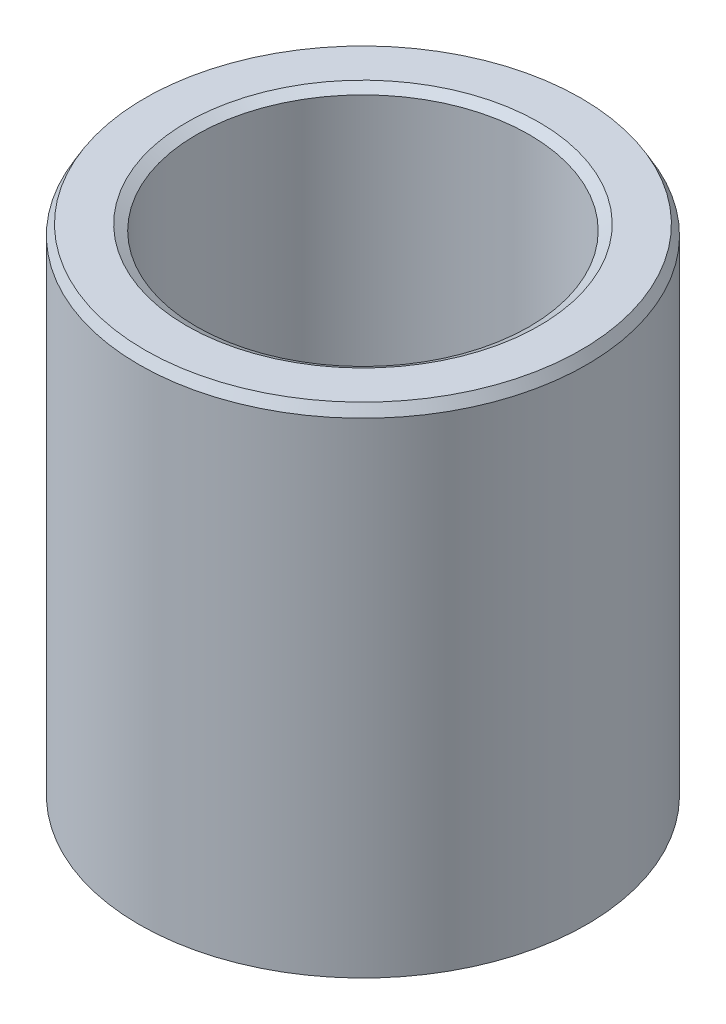
ISO-10303-21;
HEADER;
FILE_DESCRIPTION(('STEP AP214'),'2;1');
FILE_NAME('part.step','',(''),(''),'','','');
FILE_SCHEMA(('AUTOMOTIVE_DESIGN { 1 0 10303 214 1 1 1 1 }'));
ENDSEC;
DATA;
#1=APPLICATION_CONTEXT('core data for automotive mechanical design processes');
#2=APPLICATION_PROTOCOL_DEFINITION('international standard','automotive_design',2000,#1);
#3=PRODUCT_CONTEXT('',#1,'mechanical');
#4=PRODUCT('Part','Part','',(#3));
#5=PRODUCT_RELATED_PRODUCT_CATEGORY('part','',(#4));
#6=PRODUCT_DEFINITION_FORMATION('','',#4);
#7=PRODUCT_DEFINITION_CONTEXT('part definition',#1,'design');
#8=PRODUCT_DEFINITION('design','',#6,#7);
#9=PRODUCT_DEFINITION_SHAPE('','',#8);
#10=(LENGTH_UNIT() NAMED_UNIT(*) SI_UNIT(.MILLI.,.METRE.));
#11=(NAMED_UNIT(*) PLANE_ANGLE_UNIT() SI_UNIT($,.RADIAN.));
#12=(NAMED_UNIT(*) SI_UNIT($,.STERADIAN.) SOLID_ANGLE_UNIT());
#13=UNCERTAINTY_MEASURE_WITH_UNIT(LENGTH_MEASURE(1.E-05),#10,'distance_accuracy_value','');
#14=(GEOMETRIC_REPRESENTATION_CONTEXT(3) GLOBAL_UNCERTAINTY_ASSIGNED_CONTEXT((#13)) GLOBAL_UNIT_ASSIGNED_CONTEXT((#10,
#11,#12)) REPRESENTATION_CONTEXT('',''));
#15=CARTESIAN_POINT('',(0.,0.,0.));
#16=DIRECTION('',(0.,0.,1.));
#17=DIRECTION('',(1.,0.,0.));
#18=AXIS2_PLACEMENT_3D('',#15,#16,#17);
#19=CARTESIAN_POINT('',(0.,50.2971991655654,0.));
#20=DIRECTION('',(0.,-1.,0.));
#21=DIRECTION('',(0.,0.,-1.));
#22=AXIS2_PLACEMENT_3D('',#19,#20,#21);
#23=CYLINDRICAL_SURFACE('',#22,22.5);
#24=CARTESIAN_POINT('',(0.,0.574537010156938,0.));
#25=DIRECTION('',(0.,1.,0.));
#26=DIRECTION('',(0.,0.,1.));
#27=AXIS2_PLACEMENT_3D('',#24,#25,#26);
#28=CIRCLE('',#27,22.5);
#29=CARTESIAN_POINT('',(0.,0.574537010156938,22.5));
#30=VERTEX_POINT('',#29);
#31=EDGE_CURVE('E10',#30,#30,#28,.T.);
#32=ORIENTED_EDGE('',*,*,#31,.T.);
#33=EDGE_LOOP('',(#32));
#34=FACE_BOUND('',#33,.T.);
#35=CARTESIAN_POINT('',(0.,49.3020718731448,0.));
#36=DIRECTION('',(0.,1.,0.));
#37=DIRECTION('',(0.,0.,1.));
#38=AXIS2_PLACEMENT_3D('',#35,#36,#37);
#39=CIRCLE('',#38,22.5);
#40=CARTESIAN_POINT('',(0.,49.3020718731448,22.5));
#41=VERTEX_POINT('',#40);
#42=EDGE_CURVE('E50',#41,#41,#39,.F.);
#43=ORIENTED_EDGE('',*,*,#42,.T.);
#44=EDGE_LOOP('',(#43));
#45=FACE_BOUND('',#44,.T.);
#46=ADVANCED_FACE('F39',(#34,#45),#23,.T.);
#47=CARTESIAN_POINT('',(0.,50.2971991655654,0.));
#48=DIRECTION('',(0.,1.,0.));
#49=DIRECTION('',(0.,0.,1.));
#50=AXIS2_PLACEMENT_3D('',#47,#48,#49);
#51=PLANE('',#50);
#52=CARTESIAN_POINT('',(0.,50.2971991655654,0.));
#53=DIRECTION('',(0.,1.,0.));
#54=DIRECTION('',(0.,0.,1.));
#55=AXIS2_PLACEMENT_3D('',#52,#53,#54);
#56=CIRCLE('',#55,17.7167787258586);
#57=CARTESIAN_POINT('',(0.,50.2971991655654,17.7167787258586));
#58=VERTEX_POINT('',#57);
#59=EDGE_CURVE('E58',#58,#58,#56,.F.);
#60=ORIENTED_EDGE('',*,*,#59,.T.);
#61=EDGE_LOOP('',(#60));
#62=FACE_BOUND('',#61,.T.);
#63=CARTESIAN_POINT('',(0.,50.2971991655654,0.));
#64=DIRECTION('',(0.,1.,0.));
#65=DIRECTION('',(0.,0.,1.));
#66=AXIS2_PLACEMENT_3D('',#63,#64,#65);
#67=CIRCLE('',#66,21.9254629898431);
#68=CARTESIAN_POINT('',(0.,50.2971991655654,21.9254629898431));
#69=VERTEX_POINT('',#68);
#70=EDGE_CURVE('E61',#69,#69,#67,.T.);
#71=ORIENTED_EDGE('',*,*,#70,.T.);
#72=EDGE_LOOP('',(#71));
#73=FACE_BOUND('',#72,.T.);
#74=ADVANCED_FACE('F88',(#62,#73),#51,.T.);
#75=CARTESIAN_POINT('',(0.,0.,0.));
#76=DIRECTION('',(0.,1.,0.));
#77=DIRECTION('',(0.,0.,1.));
#78=AXIS2_PLACEMENT_3D('',#75,#76,#77);
#79=PLANE('',#78);
#80=CARTESIAN_POINT('',(0.,0.,0.));
#81=DIRECTION('',(0.,1.,0.));
#82=DIRECTION('',(0.,0.,1.));
#83=AXIS2_PLACEMENT_3D('',#80,#81,#82);
#84=CIRCLE('',#83,17.296188443595);
#85=CARTESIAN_POINT('',(0.,0.,17.296188443595));
#86=VERTEX_POINT('',#85);
#87=EDGE_CURVE('E51',#86,#86,#84,.T.);
#88=ORIENTED_EDGE('',*,*,#87,.T.);
#89=EDGE_LOOP('',(#88));
#90=FACE_BOUND('',#89,.T.);
#91=CARTESIAN_POINT('',(0.,0.,0.));
#92=DIRECTION('',(0.,1.,0.));
#93=DIRECTION('',(0.,0.,1.));
#94=AXIS2_PLACEMENT_3D('',#91,#92,#93);
#95=CIRCLE('',#94,21.5048727075795);
#96=CARTESIAN_POINT('',(0.,0.,21.5048727075795));
#97=VERTEX_POINT('',#96);
#98=EDGE_CURVE('E54',#97,#97,#95,.F.);
#99=ORIENTED_EDGE('',*,*,#98,.T.);
#100=EDGE_LOOP('',(#99));
#101=FACE_BOUND('',#100,.T.);
#102=ADVANCED_FACE('F83',(#90,#101),#79,.F.);
#103=CARTESIAN_POINT('',(0.,50.2971991655654,0.));
#104=DIRECTION('',(0.,-1.,0.));
#105=DIRECTION('',(0.,0.,-1.));
#106=AXIS2_PLACEMENT_3D('',#103,#104,#105);
#107=CYLINDRICAL_SURFACE('',#106,16.7216514334381);
#108=CARTESIAN_POINT('',(0.,49.7226621554085,0.));
#109=DIRECTION('',(0.,1.,0.));
#110=DIRECTION('',(0.,0.,1.));
#111=AXIS2_PLACEMENT_3D('',#108,#109,#110);
#112=CIRCLE('',#111,16.7216514334381);
#113=CARTESIAN_POINT('',(0.,49.7226621554085,16.7216514334381));
#114=VERTEX_POINT('',#113);
#115=EDGE_CURVE('E67',#114,#114,#112,.T.);
#116=ORIENTED_EDGE('',*,*,#115,.T.);
#117=EDGE_LOOP('',(#116));
#118=FACE_BOUND('',#117,.T.);
#119=CARTESIAN_POINT('',(0.,0.995127292420524,0.));
#120=DIRECTION('',(0.,1.,0.));
#121=DIRECTION('',(0.,0.,1.));
#122=AXIS2_PLACEMENT_3D('',#119,#120,#121);
#123=CIRCLE('',#122,16.7216514334381);
#124=CARTESIAN_POINT('',(0.,0.995127292420524,16.7216514334381));
#125=VERTEX_POINT('',#124);
#126=EDGE_CURVE('E69',#125,#125,#123,.F.);
#127=ORIENTED_EDGE('',*,*,#126,.T.);
#128=EDGE_LOOP('',(#127));
#129=FACE_BOUND('',#128,.T.);
#130=ADVANCED_FACE('F71',(#118,#129),#107,.F.);
#131=CARTESIAN_POINT('',(0.,49.7226621554085,0.));
#132=DIRECTION('',(0.,1.,0.));
#133=DIRECTION('',(0.,0.,1.));
#134=AXIS2_PLACEMENT_3D('',#131,#132,#133);
#135=CONICAL_SURFACE('',#134,16.7216514334381,1.0471975511966);
#136=ORIENTED_EDGE('',*,*,#59,.F.);
#137=EDGE_LOOP('',(#136));
#138=FACE_BOUND('',#137,.T.);
#139=ORIENTED_EDGE('',*,*,#115,.F.);
#140=EDGE_LOOP('',(#139));
#141=FACE_BOUND('',#140,.T.);
#142=ADVANCED_FACE('F77',(#138,#141),#135,.F.);
#143=CARTESIAN_POINT('',(0.,0.,0.));
#144=DIRECTION('',(0.,-1.,0.));
#145=DIRECTION('',(0.,0.,-1.));
#146=AXIS2_PLACEMENT_3D('',#143,#144,#145);
#147=CONICAL_SURFACE('',#146,17.296188443595,0.523598775598297);
#148=ORIENTED_EDGE('',*,*,#126,.F.);
#149=EDGE_LOOP('',(#148));
#150=FACE_BOUND('',#149,.T.);
#151=ORIENTED_EDGE('',*,*,#87,.F.);
#152=EDGE_LOOP('',(#151));
#153=FACE_BOUND('',#152,.T.);
#154=ADVANCED_FACE('F73',(#150,#153),#147,.F.);
#155=CARTESIAN_POINT('',(0.,0.574537010156938,0.));
#156=DIRECTION('',(0.,1.,0.));
#157=DIRECTION('',(0.,0.,1.));
#158=AXIS2_PLACEMENT_3D('',#155,#156,#157);
#159=CONICAL_SURFACE('',#158,22.5,1.0471975511966);
#160=ORIENTED_EDGE('',*,*,#98,.F.);
#161=EDGE_LOOP('',(#160));
#162=FACE_BOUND('',#161,.T.);
#163=ORIENTED_EDGE('',*,*,#31,.F.);
#164=EDGE_LOOP('',(#163));
#165=FACE_BOUND('',#164,.T.);
#166=ADVANCED_FACE('F76',(#162,#165),#159,.T.);
#167=CARTESIAN_POINT('',(0.,50.2971991655654,0.));
#168=DIRECTION('',(0.,-1.,0.));
#169=DIRECTION('',(0.,0.,-1.));
#170=AXIS2_PLACEMENT_3D('',#167,#168,#169);
#171=CONICAL_SURFACE('',#170,21.9254629898431,0.52359877559829);
#172=ORIENTED_EDGE('',*,*,#42,.F.);
#173=EDGE_LOOP('',(#172));
#174=FACE_BOUND('',#173,.T.);
#175=ORIENTED_EDGE('',*,*,#70,.F.);
#176=EDGE_LOOP('',(#175));
#177=FACE_BOUND('',#176,.T.);
#178=ADVANCED_FACE('F45',(#174,#177),#171,.T.);
#179=CLOSED_SHELL('',(#46,#74,#102,#130,#142,#154,#166,#178));
#180=MANIFOLD_SOLID_BREP('B2',#179);
#181=ADVANCED_BREP_SHAPE_REPRESENTATION('',(#18,#180),#14);
#182=SHAPE_DEFINITION_REPRESENTATION(#9,#181);
ENDSEC;
END-ISO-10303-21;
